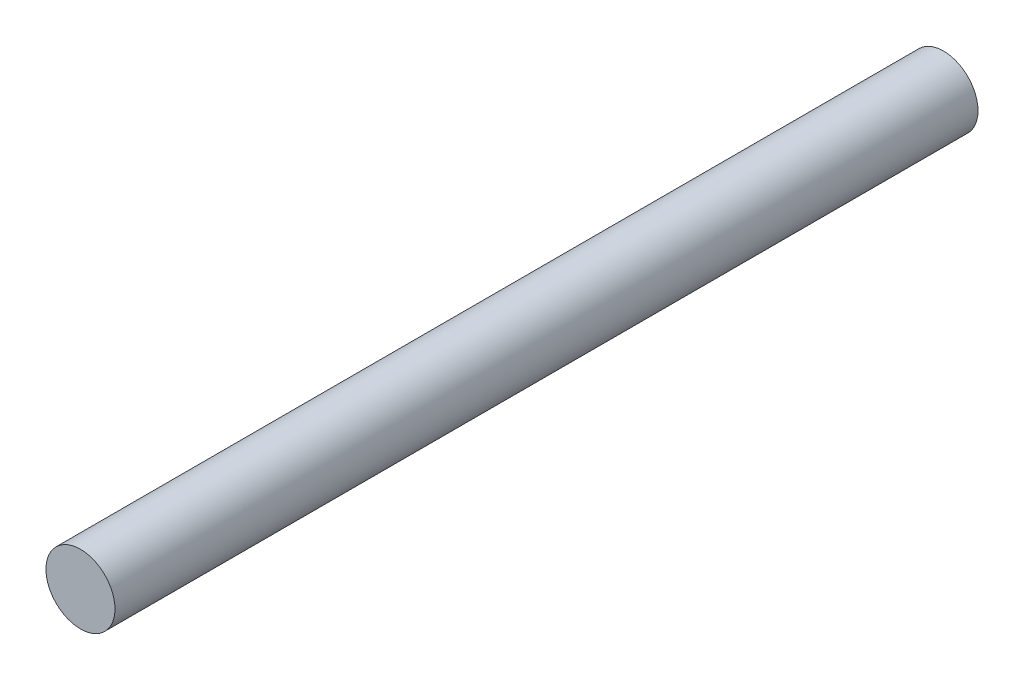
ISO-10303-21;
HEADER;
FILE_DESCRIPTION(('STEP AP214'),'2;1');
FILE_NAME('part.step','',(''),(''),'','','');
FILE_SCHEMA(('AUTOMOTIVE_DESIGN { 1 0 10303 214 1 1 1 1 }'));
ENDSEC;
DATA;
#1=APPLICATION_CONTEXT('core data for automotive mechanical design processes');
#2=APPLICATION_PROTOCOL_DEFINITION('international standard','automotive_design',2000,#1);
#3=PRODUCT_CONTEXT('',#1,'mechanical');
#4=PRODUCT('Part','Part','',(#3));
#5=PRODUCT_RELATED_PRODUCT_CATEGORY('part','',(#4));
#6=PRODUCT_DEFINITION_FORMATION('','',#4);
#7=PRODUCT_DEFINITION_CONTEXT('part definition',#1,'design');
#8=PRODUCT_DEFINITION('design','',#6,#7);
#9=PRODUCT_DEFINITION_SHAPE('','',#8);
#10=(LENGTH_UNIT() NAMED_UNIT(*) SI_UNIT(.MILLI.,.METRE.));
#11=(NAMED_UNIT(*) PLANE_ANGLE_UNIT() SI_UNIT($,.RADIAN.));
#12=(NAMED_UNIT(*) SI_UNIT($,.STERADIAN.) SOLID_ANGLE_UNIT());
#13=UNCERTAINTY_MEASURE_WITH_UNIT(LENGTH_MEASURE(1.E-05),#10,'distance_accuracy_value','');
#14=(GEOMETRIC_REPRESENTATION_CONTEXT(3) GLOBAL_UNCERTAINTY_ASSIGNED_CONTEXT((#13)) GLOBAL_UNIT_ASSIGNED_CONTEXT((#10,
#11,#12)) REPRESENTATION_CONTEXT('',''));
#15=CARTESIAN_POINT('',(0.,0.,0.));
#16=DIRECTION('',(0.,0.,1.));
#17=DIRECTION('',(1.,0.,0.));
#18=AXIS2_PLACEMENT_3D('',#15,#16,#17);
#19=CARTESIAN_POINT('',(0.,0.,100.));
#20=DIRECTION('',(0.,0.,-1.));
#21=DIRECTION('',(-1.,0.,0.));
#22=AXIS2_PLACEMENT_3D('',#19,#20,#21);
#23=CYLINDRICAL_SURFACE('',#22,4.);
#24=CARTESIAN_POINT('',(0.,0.,100.));
#25=DIRECTION('',(0.,0.,1.));
#26=DIRECTION('',(1.,0.,0.));
#27=AXIS2_PLACEMENT_3D('',#24,#25,#26);
#28=CIRCLE('',#27,4.);
#29=CARTESIAN_POINT('',(4.,0.,100.));
#30=VERTEX_POINT('',#29);
#31=EDGE_CURVE('E10',#30,#30,#28,.T.);
#32=ORIENTED_EDGE('',*,*,#31,.F.);
#33=EDGE_LOOP('',(#32));
#34=FACE_BOUND('',#33,.T.);
#35=CARTESIAN_POINT('',(0.,0.,0.));
#36=DIRECTION('',(0.,0.,1.));
#37=DIRECTION('',(1.,0.,0.));
#38=AXIS2_PLACEMENT_3D('',#35,#36,#37);
#39=CIRCLE('',#38,4.);
#40=CARTESIAN_POINT('',(4.,0.,0.));
#41=VERTEX_POINT('',#40);
#42=EDGE_CURVE('E46',#41,#41,#39,.T.);
#43=ORIENTED_EDGE('',*,*,#42,.T.);
#44=EDGE_LOOP('',(#43));
#45=FACE_BOUND('',#44,.T.);
#46=ADVANCED_FACE('F43',(#34,#45),#23,.T.);
#47=CARTESIAN_POINT('',(0.,0.,100.));
#48=DIRECTION('',(0.,0.,1.));
#49=DIRECTION('',(1.,0.,0.));
#50=AXIS2_PLACEMENT_3D('',#47,#48,#49);
#51=PLANE('',#50);
#52=ORIENTED_EDGE('',*,*,#31,.T.);
#53=EDGE_LOOP('',(#52));
#54=FACE_BOUND('',#53,.T.);
#55=ADVANCED_FACE('F60',(#54),#51,.T.);
#56=CARTESIAN_POINT('',(0.,0.,0.));
#57=DIRECTION('',(0.,0.,1.));
#58=DIRECTION('',(1.,0.,0.));
#59=AXIS2_PLACEMENT_3D('',#56,#57,#58);
#60=PLANE('',#59);
#61=ORIENTED_EDGE('',*,*,#42,.F.);
#62=EDGE_LOOP('',(#61));
#63=FACE_BOUND('',#62,.T.);
#64=ADVANCED_FACE('F58',(#63),#60,.F.);
#65=CLOSED_SHELL('',(#46,#55,#64));
#66=MANIFOLD_SOLID_BREP('B2',#65);
#67=ADVANCED_BREP_SHAPE_REPRESENTATION('',(#18,#66),#14);
#68=SHAPE_DEFINITION_REPRESENTATION(#9,#67);
ENDSEC;
END-ISO-10303-21;
